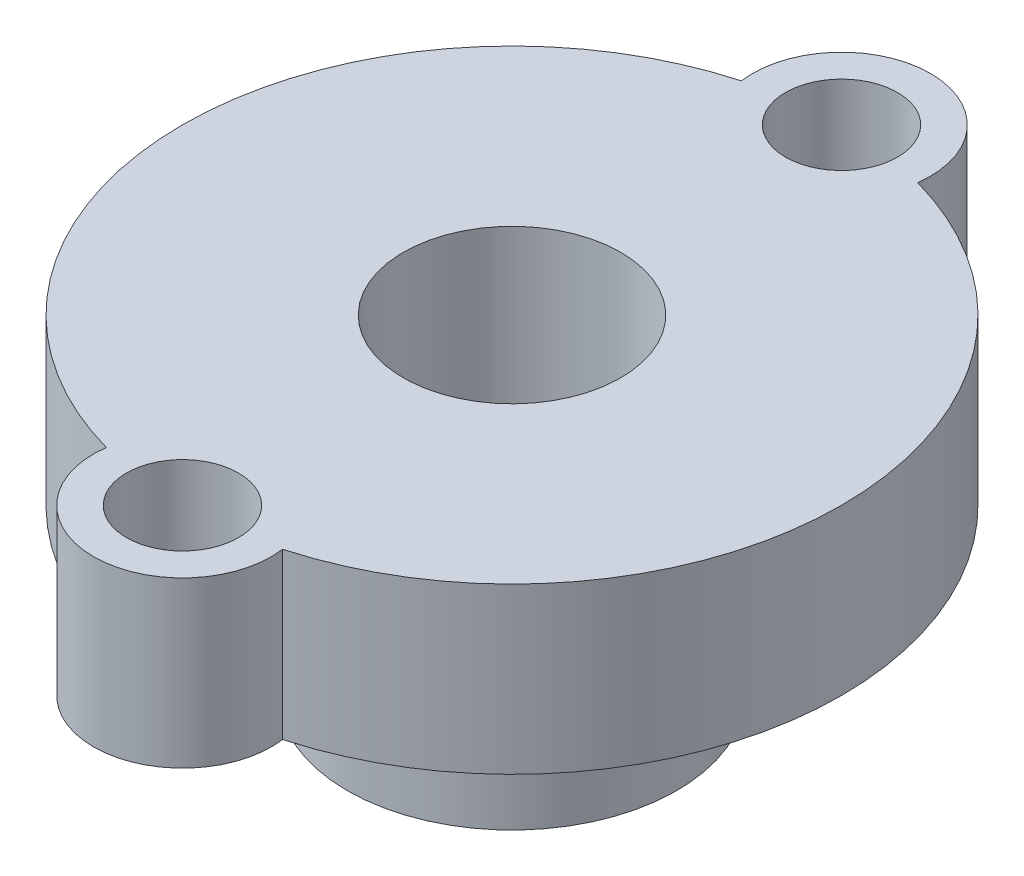
ISO-10303-21;
HEADER;
FILE_DESCRIPTION(('STEP AP214'),'2;1');
FILE_NAME('part.step','',(''),(''),'','','');
FILE_SCHEMA(('AUTOMOTIVE_DESIGN { 1 0 10303 214 1 1 1 1 }'));
ENDSEC;
DATA;
#1=APPLICATION_CONTEXT('core data for automotive mechanical design processes');
#2=APPLICATION_PROTOCOL_DEFINITION('international standard','automotive_design',2000,#1);
#3=PRODUCT_CONTEXT('',#1,'mechanical');
#4=PRODUCT('Part','Part','',(#3));
#5=PRODUCT_RELATED_PRODUCT_CATEGORY('part','',(#4));
#6=PRODUCT_DEFINITION_FORMATION('','',#4);
#7=PRODUCT_DEFINITION_CONTEXT('part definition',#1,'design');
#8=PRODUCT_DEFINITION('design','',#6,#7);
#9=PRODUCT_DEFINITION_SHAPE('','',#8);
#10=(LENGTH_UNIT() NAMED_UNIT(*) SI_UNIT(.MILLI.,.METRE.));
#11=(NAMED_UNIT(*) PLANE_ANGLE_UNIT() SI_UNIT($,.RADIAN.));
#12=(NAMED_UNIT(*) SI_UNIT($,.STERADIAN.) SOLID_ANGLE_UNIT());
#13=UNCERTAINTY_MEASURE_WITH_UNIT(LENGTH_MEASURE(1.E-05),#10,'distance_accuracy_value','');
#14=(GEOMETRIC_REPRESENTATION_CONTEXT(3) GLOBAL_UNCERTAINTY_ASSIGNED_CONTEXT((#13)) GLOBAL_UNIT_ASSIGNED_CONTEXT((#10,
#11,#12)) REPRESENTATION_CONTEXT('',''));
#15=CARTESIAN_POINT('',(0.,0.,0.));
#16=DIRECTION('',(0.,0.,1.));
#17=DIRECTION('',(1.,0.,0.));
#18=AXIS2_PLACEMENT_3D('',#15,#16,#17);
#19=CARTESIAN_POINT('',(0.,5.,0.));
#20=DIRECTION('',(0.,-1.,0.));
#21=DIRECTION('',(0.,0.,-1.));
#22=AXIS2_PLACEMENT_3D('',#19,#20,#21);
#23=CYLINDRICAL_SURFACE('',#22,5.);
#24=CARTESIAN_POINT('',(0.,5.,0.));
#25=DIRECTION('',(0.,1.,0.));
#26=DIRECTION('',(0.,0.,1.));
#27=AXIS2_PLACEMENT_3D('',#24,#25,#26);
#28=CIRCLE('',#27,5.);
#29=CARTESIAN_POINT('',(0.,5.,5.));
#30=VERTEX_POINT('',#29);
#31=EDGE_CURVE('E11',#30,#30,#28,.T.);
#32=ORIENTED_EDGE('',*,*,#31,.F.);
#33=EDGE_LOOP('',(#32));
#34=FACE_BOUND('',#33,.T.);
#35=CARTESIAN_POINT('',(0.,0.,0.));
#36=DIRECTION('',(0.,1.,0.));
#37=DIRECTION('',(0.,0.,1.));
#38=AXIS2_PLACEMENT_3D('',#35,#36,#37);
#39=CIRCLE('',#38,5.);
#40=CARTESIAN_POINT('',(0.,0.,5.));
#41=VERTEX_POINT('',#40);
#42=EDGE_CURVE('E36',#41,#41,#39,.T.);
#43=ORIENTED_EDGE('',*,*,#42,.T.);
#44=EDGE_LOOP('',(#43));
#45=FACE_BOUND('',#44,.T.);
#46=ADVANCED_FACE('F33',(#34,#45),#23,.T.);
#47=CARTESIAN_POINT('',(0.,0.,0.));
#48=DIRECTION('',(0.,1.,0.));
#49=DIRECTION('',(0.,0.,1.));
#50=AXIS2_PLACEMENT_3D('',#47,#48,#49);
#51=PLANE('',#50);
#52=CARTESIAN_POINT('',(0.,0.,0.));
#53=DIRECTION('',(0.,-1.,0.));
#54=DIRECTION('',(0.,0.,-1.));
#55=AXIS2_PLACEMENT_3D('',#52,#53,#54);
#56=CIRCLE('',#55,3.29999999999999);
#57=CARTESIAN_POINT('',(0.,0.,-3.29999999999999));
#58=VERTEX_POINT('',#57);
#59=EDGE_CURVE('E159',#58,#58,#56,.T.);
#60=ORIENTED_EDGE('',*,*,#59,.F.);
#61=EDGE_LOOP('',(#60));
#62=FACE_BOUND('',#61,.T.);
#63=ORIENTED_EDGE('',*,*,#42,.F.);
#64=EDGE_LOOP('',(#63));
#65=FACE_BOUND('',#64,.T.);
#66=ADVANCED_FACE('F114',(#62,#65),#51,.F.);
#67=CARTESIAN_POINT('',(0.,10.,-5.));
#68=DIRECTION('',(0.,1.,0.));
#69=DIRECTION('',(0.,0.,1.));
#70=AXIS2_PLACEMENT_3D('',#67,#68,#69);
#71=PLANE('',#70);
#72=CARTESIAN_POINT('',(0.,10.,0.));
#73=DIRECTION('',(0.,-1.,0.));
#74=DIRECTION('',(0.,0.,-1.));
#75=AXIS2_PLACEMENT_3D('',#72,#73,#74);
#76=CIRCLE('',#75,3.3);
#77=CARTESIAN_POINT('',(0.,10.,-3.3));
#78=VERTEX_POINT('',#77);
#79=EDGE_CURVE('E157',#78,#78,#76,.T.);
#80=ORIENTED_EDGE('',*,*,#79,.T.);
#81=EDGE_LOOP('',(#80));
#82=FACE_BOUND('',#81,.T.);
#83=CARTESIAN_POINT('',(0.,10.,-10.));
#84=DIRECTION('',(0.,1.,0.));
#85=DIRECTION('',(0.,0.,1.));
#86=AXIS2_PLACEMENT_3D('',#83,#84,#85);
#87=CIRCLE('',#86,1.7);
#88=CARTESIAN_POINT('',(0.,10.,-8.3));
#89=VERTEX_POINT('',#88);
#90=EDGE_CURVE('E104',#89,#89,#87,.T.);
#91=ORIENTED_EDGE('',*,*,#90,.F.);
#92=EDGE_LOOP('',(#91));
#93=FACE_BOUND('',#92,.T.);
#94=CARTESIAN_POINT('',(0.,10.,-10.));
#95=DIRECTION('',(0.,1.,0.));
#96=DIRECTION('',(0.,0.,1.));
#97=AXIS2_PLACEMENT_3D('',#94,#95,#96);
#98=CIRCLE('',#97,2.7);
#99=CARTESIAN_POINT('',(2.67528311585896,10.,-9.6355));
#100=VERTEX_POINT('',#99);
#101=CARTESIAN_POINT('',(-2.67528311585895,10.,-9.6355));
#102=VERTEX_POINT('',#101);
#103=EDGE_CURVE('E86',#100,#102,#98,.T.);
#104=ORIENTED_EDGE('',*,*,#103,.T.);
#105=CARTESIAN_POINT('',(0.,10.,0.));
#106=DIRECTION('',(0.,1.,0.));
#107=DIRECTION('',(0.,0.,1.));
#108=AXIS2_PLACEMENT_3D('',#105,#106,#107);
#109=CIRCLE('',#108,10.);
#110=CARTESIAN_POINT('',(-2.67528311585896,10.,9.6355));
#111=VERTEX_POINT('',#110);
#112=EDGE_CURVE('E80',#102,#111,#109,.T.);
#113=ORIENTED_EDGE('',*,*,#112,.T.);
#114=CARTESIAN_POINT('',(0.,10.,10.));
#115=DIRECTION('',(0.,1.,0.));
#116=DIRECTION('',(0.,0.,-1.));
#117=AXIS2_PLACEMENT_3D('',#114,#115,#116);
#118=CIRCLE('',#117,2.7);
#119=CARTESIAN_POINT('',(2.67528311585896,10.,9.6355));
#120=VERTEX_POINT('',#119);
#121=EDGE_CURVE('E84',#111,#120,#118,.T.);
#122=ORIENTED_EDGE('',*,*,#121,.T.);
#123=CARTESIAN_POINT('',(0.,10.,0.));
#124=DIRECTION('',(0.,1.,0.));
#125=DIRECTION('',(0.,0.,1.));
#126=AXIS2_PLACEMENT_3D('',#123,#124,#125);
#127=CIRCLE('',#126,10.);
#128=EDGE_CURVE('E49',#120,#100,#127,.T.);
#129=ORIENTED_EDGE('',*,*,#128,.T.);
#130=EDGE_LOOP('',(#104,#113,#122,#129));
#131=FACE_BOUND('',#130,.T.);
#132=CARTESIAN_POINT('',(0.,10.,10.));
#133=DIRECTION('',(0.,1.,0.));
#134=DIRECTION('',(0.,0.,-1.));
#135=AXIS2_PLACEMENT_3D('',#132,#133,#134);
#136=CIRCLE('',#135,1.7);
#137=CARTESIAN_POINT('',(0.,10.,8.3));
#138=VERTEX_POINT('',#137);
#139=EDGE_CURVE('E164',#138,#138,#136,.T.);
#140=ORIENTED_EDGE('',*,*,#139,.F.);
#141=EDGE_LOOP('',(#140));
#142=FACE_BOUND('',#141,.T.);
#143=ADVANCED_FACE('F81',(#82,#93,#131,#142),#71,.T.);
#144=CARTESIAN_POINT('',(0.,5.,-5.));
#145=DIRECTION('',(0.,1.,0.));
#146=DIRECTION('',(0.,0.,1.));
#147=AXIS2_PLACEMENT_3D('',#144,#145,#146);
#148=PLANE('',#147);
#149=ORIENTED_EDGE('',*,*,#31,.T.);
#150=EDGE_LOOP('',(#149));
#151=FACE_BOUND('',#150,.T.);
#152=CARTESIAN_POINT('',(0.,5.,-10.));
#153=DIRECTION('',(0.,1.,0.));
#154=DIRECTION('',(0.,0.,1.));
#155=AXIS2_PLACEMENT_3D('',#152,#153,#154);
#156=CIRCLE('',#155,2.7);
#157=CARTESIAN_POINT('',(2.67528311585896,5.,-9.6355));
#158=VERTEX_POINT('',#157);
#159=CARTESIAN_POINT('',(-2.67528311585895,5.,-9.6355));
#160=VERTEX_POINT('',#159);
#161=EDGE_CURVE('E101',#158,#160,#156,.T.);
#162=ORIENTED_EDGE('',*,*,#161,.F.);
#163=CARTESIAN_POINT('',(0.,5.,0.));
#164=DIRECTION('',(0.,1.,0.));
#165=DIRECTION('',(0.,0.,1.));
#166=AXIS2_PLACEMENT_3D('',#163,#164,#165);
#167=CIRCLE('',#166,10.);
#168=CARTESIAN_POINT('',(2.67528311585896,5.,9.6355));
#169=VERTEX_POINT('',#168);
#170=EDGE_CURVE('E72',#169,#158,#167,.T.);
#171=ORIENTED_EDGE('',*,*,#170,.F.);
#172=CARTESIAN_POINT('',(0.,5.,10.));
#173=DIRECTION('',(0.,1.,0.));
#174=DIRECTION('',(0.,0.,-1.));
#175=AXIS2_PLACEMENT_3D('',#172,#173,#174);
#176=CIRCLE('',#175,2.7);
#177=CARTESIAN_POINT('',(-2.67528311585896,5.,9.6355));
#178=VERTEX_POINT('',#177);
#179=EDGE_CURVE('E66',#178,#169,#176,.T.);
#180=ORIENTED_EDGE('',*,*,#179,.F.);
#181=CARTESIAN_POINT('',(0.,5.,0.));
#182=DIRECTION('',(0.,1.,0.));
#183=DIRECTION('',(0.,0.,1.));
#184=AXIS2_PLACEMENT_3D('',#181,#182,#183);
#185=CIRCLE('',#184,10.);
#186=EDGE_CURVE('E91',#160,#178,#185,.T.);
#187=ORIENTED_EDGE('',*,*,#186,.F.);
#188=EDGE_LOOP('',(#162,#171,#180,#187));
#189=FACE_BOUND('',#188,.T.);
#190=CARTESIAN_POINT('',(0.,5.,-10.));
#191=DIRECTION('',(0.,1.,0.));
#192=DIRECTION('',(0.,0.,1.));
#193=AXIS2_PLACEMENT_3D('',#190,#191,#192);
#194=CIRCLE('',#193,1.7);
#195=CARTESIAN_POINT('',(0.,5.,-8.3));
#196=VERTEX_POINT('',#195);
#197=EDGE_CURVE('E167',#196,#196,#194,.T.);
#198=ORIENTED_EDGE('',*,*,#197,.T.);
#199=EDGE_LOOP('',(#198));
#200=FACE_BOUND('',#199,.T.);
#201=CARTESIAN_POINT('',(0.,5.,10.));
#202=DIRECTION('',(0.,1.,0.));
#203=DIRECTION('',(0.,0.,-1.));
#204=AXIS2_PLACEMENT_3D('',#201,#202,#203);
#205=CIRCLE('',#204,1.7);
#206=CARTESIAN_POINT('',(0.,5.,8.3));
#207=VERTEX_POINT('',#206);
#208=EDGE_CURVE('E161',#207,#207,#205,.T.);
#209=ORIENTED_EDGE('',*,*,#208,.T.);
#210=EDGE_LOOP('',(#209));
#211=FACE_BOUND('',#210,.T.);
#212=ADVANCED_FACE('F121',(#151,#189,#200,#211),#148,.F.);
#213=CARTESIAN_POINT('',(0.,10.,-10.));
#214=DIRECTION('',(0.,-1.,0.));
#215=DIRECTION('',(0.,0.,-1.));
#216=AXIS2_PLACEMENT_3D('',#213,#214,#215);
#217=CYLINDRICAL_SURFACE('',#216,2.7);
#218=ORIENTED_EDGE('',*,*,#161,.T.);
#219=DIRECTION('',(0.,-1.,0.));
#220=VECTOR('',#219,1.);
#221=CARTESIAN_POINT('',(-2.67528311585895,10.,-9.6355));
#222=LINE('',#221,#220);
#223=EDGE_CURVE('E92',#102,#160,#222,.T.);
#224=ORIENTED_EDGE('',*,*,#223,.F.);
#225=ORIENTED_EDGE('',*,*,#103,.F.);
#226=DIRECTION('',(0.,-1.,0.));
#227=VECTOR('',#226,1.);
#228=CARTESIAN_POINT('',(2.67528311585896,10.,-9.6355));
#229=LINE('',#228,#227);
#230=EDGE_CURVE('E97',#100,#158,#229,.T.);
#231=ORIENTED_EDGE('',*,*,#230,.T.);
#232=EDGE_LOOP('',(#218,#224,#225,#231));
#233=FACE_BOUND('',#232,.T.);
#234=ADVANCED_FACE('F127',(#233),#217,.T.);
#235=CARTESIAN_POINT('',(0.,10.,0.));
#236=DIRECTION('',(0.,-1.,0.));
#237=DIRECTION('',(0.,0.,-1.));
#238=AXIS2_PLACEMENT_3D('',#235,#236,#237);
#239=CYLINDRICAL_SURFACE('',#238,10.);
#240=ORIENTED_EDGE('',*,*,#186,.T.);
#241=DIRECTION('',(0.,-1.,0.));
#242=VECTOR('',#241,1.);
#243=CARTESIAN_POINT('',(-2.67528311585896,10.,9.6355));
#244=LINE('',#243,#242);
#245=EDGE_CURVE('E89',#111,#178,#244,.T.);
#246=ORIENTED_EDGE('',*,*,#245,.F.);
#247=ORIENTED_EDGE('',*,*,#112,.F.);
#248=ORIENTED_EDGE('',*,*,#223,.T.);
#249=EDGE_LOOP('',(#240,#246,#247,#248));
#250=FACE_BOUND('',#249,.T.);
#251=ADVANCED_FACE('F90',(#250),#239,.T.);
#252=CARTESIAN_POINT('',(0.,10.,10.));
#253=DIRECTION('',(0.,-1.,0.));
#254=DIRECTION('',(0.,0.,-1.));
#255=AXIS2_PLACEMENT_3D('',#252,#253,#254);
#256=CYLINDRICAL_SURFACE('',#255,2.7);
#257=ORIENTED_EDGE('',*,*,#179,.T.);
#258=DIRECTION('',(0.,-1.,0.));
#259=VECTOR('',#258,1.);
#260=CARTESIAN_POINT('',(2.67528311585896,10.,9.6355));
#261=LINE('',#260,#259);
#262=EDGE_CURVE('E93',#120,#169,#261,.T.);
#263=ORIENTED_EDGE('',*,*,#262,.F.);
#264=ORIENTED_EDGE('',*,*,#121,.F.);
#265=ORIENTED_EDGE('',*,*,#245,.T.);
#266=EDGE_LOOP('',(#257,#263,#264,#265));
#267=FACE_BOUND('',#266,.T.);
#268=ADVANCED_FACE('F95',(#267),#256,.T.);
#269=CARTESIAN_POINT('',(0.,10.,0.));
#270=DIRECTION('',(0.,-1.,0.));
#271=DIRECTION('',(0.,0.,-1.));
#272=AXIS2_PLACEMENT_3D('',#269,#270,#271);
#273=CYLINDRICAL_SURFACE('',#272,10.);
#274=ORIENTED_EDGE('',*,*,#170,.T.);
#275=ORIENTED_EDGE('',*,*,#230,.F.);
#276=ORIENTED_EDGE('',*,*,#128,.F.);
#277=ORIENTED_EDGE('',*,*,#262,.T.);
#278=EDGE_LOOP('',(#274,#275,#276,#277));
#279=FACE_BOUND('',#278,.T.);
#280=ADVANCED_FACE('F135',(#279),#273,.T.);
#281=CARTESIAN_POINT('',(0.,10.,-10.));
#282=DIRECTION('',(0.,-1.,0.));
#283=DIRECTION('',(0.,0.,-1.));
#284=AXIS2_PLACEMENT_3D('',#281,#282,#283);
#285=CYLINDRICAL_SURFACE('',#284,1.7);
#286=ORIENTED_EDGE('',*,*,#90,.T.);
#287=EDGE_LOOP('',(#286));
#288=FACE_BOUND('',#287,.T.);
#289=ORIENTED_EDGE('',*,*,#197,.F.);
#290=EDGE_LOOP('',(#289));
#291=FACE_BOUND('',#290,.T.);
#292=ADVANCED_FACE('F138',(#288,#291),#285,.F.);
#293=CARTESIAN_POINT('',(0.,10.,10.));
#294=DIRECTION('',(0.,-1.,0.));
#295=DIRECTION('',(0.,0.,-1.));
#296=AXIS2_PLACEMENT_3D('',#293,#294,#295);
#297=CYLINDRICAL_SURFACE('',#296,1.7);
#298=ORIENTED_EDGE('',*,*,#139,.T.);
#299=EDGE_LOOP('',(#298));
#300=FACE_BOUND('',#299,.T.);
#301=ORIENTED_EDGE('',*,*,#208,.F.);
#302=EDGE_LOOP('',(#301));
#303=FACE_BOUND('',#302,.T.);
#304=ADVANCED_FACE('F144',(#300,#303),#297,.F.);
#305=CARTESIAN_POINT('',(0.,0.,0.));
#306=DIRECTION('',(0.,-1.,0.));
#307=DIRECTION('',(0.,0.,-1.));
#308=AXIS2_PLACEMENT_3D('',#305,#306,#307);
#309=CYLINDRICAL_SURFACE('',#308,3.29999999999999);
#310=ORIENTED_EDGE('',*,*,#79,.F.);
#311=EDGE_LOOP('',(#310));
#312=FACE_BOUND('',#311,.T.);
#313=ORIENTED_EDGE('',*,*,#59,.T.);
#314=EDGE_LOOP('',(#313));
#315=FACE_BOUND('',#314,.T.);
#316=ADVANCED_FACE('F148',(#312,#315),#309,.F.);
#317=CLOSED_SHELL('',(#46,#66,#143,#212,#234,#251,#268,#280,#292,#304,#316));
#318=MANIFOLD_SOLID_BREP('B2',#317);
#319=ADVANCED_BREP_SHAPE_REPRESENTATION('',(#18,#318),#14);
#320=SHAPE_DEFINITION_REPRESENTATION(#9,#319);
ENDSEC;
END-ISO-10303-21;
